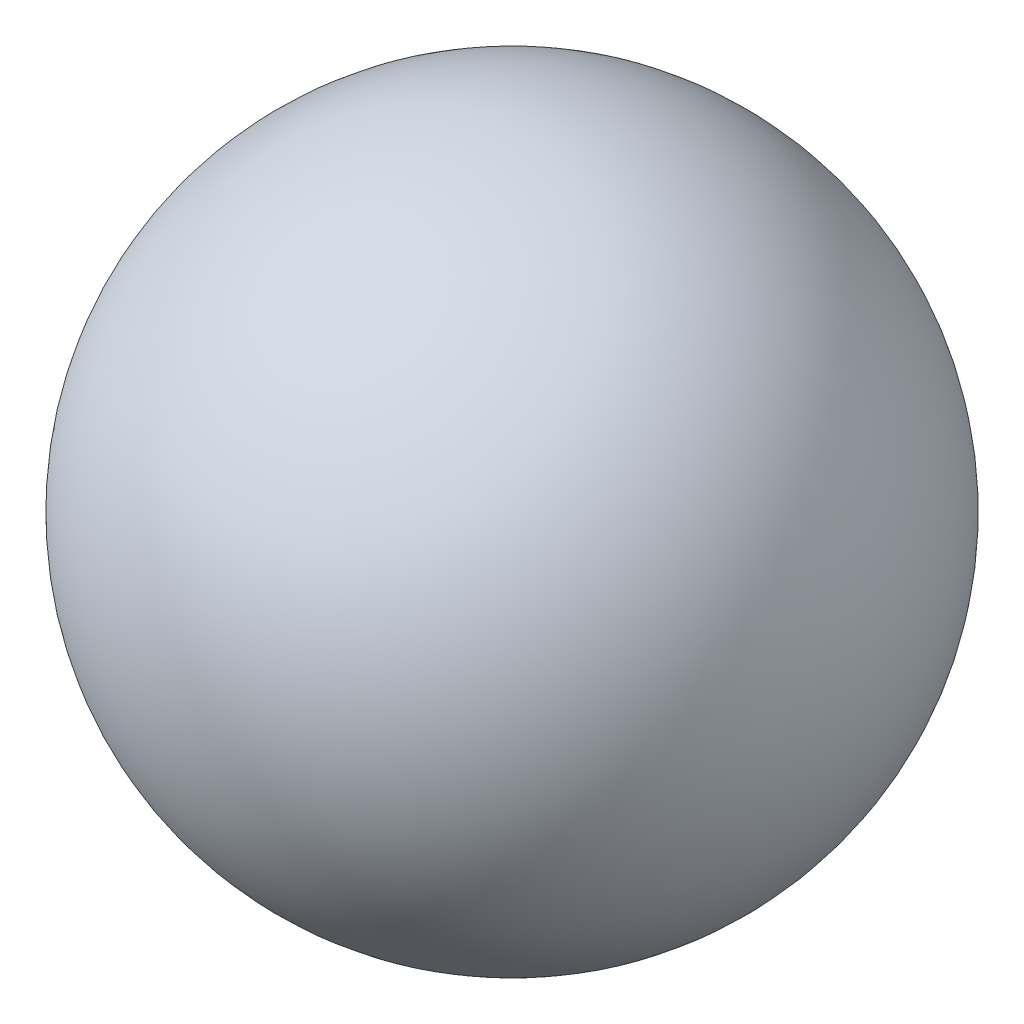
ISO-10303-21;
HEADER;
FILE_DESCRIPTION(('STEP AP214'),'2;1');
FILE_NAME('part.step','',(''),(''),'','','');
FILE_SCHEMA(('AUTOMOTIVE_DESIGN { 1 0 10303 214 1 1 1 1 }'));
ENDSEC;
DATA;
#1=APPLICATION_CONTEXT('core data for automotive mechanical design processes');
#2=APPLICATION_PROTOCOL_DEFINITION('international standard','automotive_design',2000,#1);
#3=PRODUCT_CONTEXT('',#1,'mechanical');
#4=PRODUCT('Part','Part','',(#3));
#5=PRODUCT_RELATED_PRODUCT_CATEGORY('part','',(#4));
#6=PRODUCT_DEFINITION_FORMATION('','',#4);
#7=PRODUCT_DEFINITION_CONTEXT('part definition',#1,'design');
#8=PRODUCT_DEFINITION('design','',#6,#7);
#9=PRODUCT_DEFINITION_SHAPE('','',#8);
#10=(LENGTH_UNIT() NAMED_UNIT(*) SI_UNIT(.MILLI.,.METRE.));
#11=(NAMED_UNIT(*) PLANE_ANGLE_UNIT() SI_UNIT($,.RADIAN.));
#12=(NAMED_UNIT(*) SI_UNIT($,.STERADIAN.) SOLID_ANGLE_UNIT());
#13=UNCERTAINTY_MEASURE_WITH_UNIT(LENGTH_MEASURE(1.E-05),#10,'distance_accuracy_value','');
#14=(GEOMETRIC_REPRESENTATION_CONTEXT(3) GLOBAL_UNCERTAINTY_ASSIGNED_CONTEXT((#13)) GLOBAL_UNIT_ASSIGNED_CONTEXT((#10,
#11,#12)) REPRESENTATION_CONTEXT('',''));
#15=CARTESIAN_POINT('',(0.,0.,0.));
#16=DIRECTION('',(0.,0.,1.));
#17=DIRECTION('',(1.,0.,0.));
#18=AXIS2_PLACEMENT_3D('',#15,#16,#17);
#19=CARTESIAN_POINT('',(0.,0.,0.));
#20=DIRECTION('',(0.,1.,0.));
#21=DIRECTION('',(1.,0.,0.));
#22=AXIS2_PLACEMENT_3D('',#19,#20,#21);
#23=SPHERICAL_SURFACE('',#22,109.15);
#24=CARTESIAN_POINT('',(0.,109.15,0.));
#25=VERTEX_POINT('',#24);
#26=VERTEX_LOOP('',#25);
#27=FACE_BOUND('',#26,.T.);
#28=ADVANCED_FACE('F33',(#27),#23,.T.);
#29=CLOSED_SHELL('',(#28));
#30=MANIFOLD_SOLID_BREP('B2',#29);
#31=ADVANCED_BREP_SHAPE_REPRESENTATION('',(#18,#30),#14);
#32=SHAPE_DEFINITION_REPRESENTATION(#9,#31);
ENDSEC;
END-ISO-10303-21;
